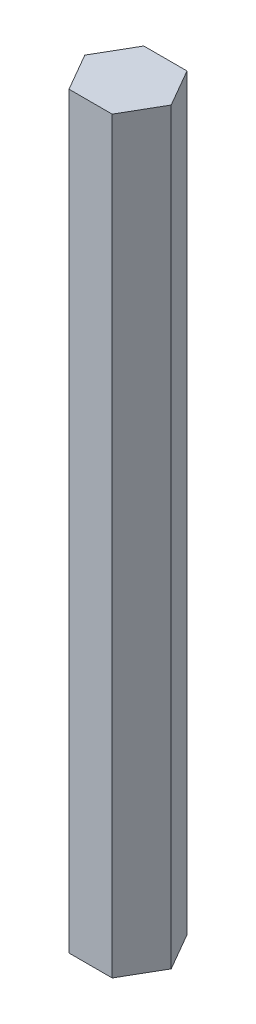
ISO-10303-21;
HEADER;
FILE_DESCRIPTION(('STEP AP214'),'2;1');
FILE_NAME('part.step','',(''),(''),'','','');
FILE_SCHEMA(('AUTOMOTIVE_DESIGN { 1 0 10303 214 1 1 1 1 }'));
ENDSEC;
DATA;
#1=APPLICATION_CONTEXT('core data for automotive mechanical design processes');
#2=APPLICATION_PROTOCOL_DEFINITION('international standard','automotive_design',2000,#1);
#3=PRODUCT_CONTEXT('',#1,'mechanical');
#4=PRODUCT('Part','Part','',(#3));
#5=PRODUCT_RELATED_PRODUCT_CATEGORY('part','',(#4));
#6=PRODUCT_DEFINITION_FORMATION('','',#4);
#7=PRODUCT_DEFINITION_CONTEXT('part definition',#1,'design');
#8=PRODUCT_DEFINITION('design','',#6,#7);
#9=PRODUCT_DEFINITION_SHAPE('','',#8);
#10=(LENGTH_UNIT() NAMED_UNIT(*) SI_UNIT(.MILLI.,.METRE.));
#11=(NAMED_UNIT(*) PLANE_ANGLE_UNIT() SI_UNIT($,.RADIAN.));
#12=(NAMED_UNIT(*) SI_UNIT($,.STERADIAN.) SOLID_ANGLE_UNIT());
#13=UNCERTAINTY_MEASURE_WITH_UNIT(LENGTH_MEASURE(1.E-05),#10,'distance_accuracy_value','');
#14=(GEOMETRIC_REPRESENTATION_CONTEXT(3) GLOBAL_UNCERTAINTY_ASSIGNED_CONTEXT((#13)) GLOBAL_UNIT_ASSIGNED_CONTEXT((#10,
#11,#12)) REPRESENTATION_CONTEXT('',''));
#15=CARTESIAN_POINT('',(0.,0.,0.));
#16=DIRECTION('',(0.,0.,1.));
#17=DIRECTION('',(1.,0.,0.));
#18=AXIS2_PLACEMENT_3D('',#15,#16,#17);
#19=CARTESIAN_POINT('',(7.33234841870825,127.,0.));
#20=DIRECTION('',(-0.866025403784438,0.,0.5));
#21=DIRECTION('',(0.5,0.,0.866025403784438));
#22=AXIS2_PLACEMENT_3D('',#19,#20,#21);
#23=PLANE('',#22);
#24=DIRECTION('',(-0.5,0.,-0.866025403784438));
#25=VECTOR('',#24,1.);
#26=CARTESIAN_POINT('',(7.33234841870825,0.,0.));
#27=LINE('',#26,#25);
#28=CARTESIAN_POINT('',(7.33234841870825,0.,0.));
#29=VERTEX_POINT('',#28);
#30=CARTESIAN_POINT('',(3.66617420935412,0.,-6.35));
#31=VERTEX_POINT('',#30);
#32=EDGE_CURVE('E117',#29,#31,#27,.T.);
#33=ORIENTED_EDGE('',*,*,#32,.T.);
#34=DIRECTION('',(0.,-1.,0.));
#35=VECTOR('',#34,1.);
#36=CARTESIAN_POINT('',(3.66617420935412,127.,-6.35));
#37=LINE('',#36,#35);
#38=CARTESIAN_POINT('',(3.66617420935412,127.,-6.35));
#39=VERTEX_POINT('',#38);
#40=EDGE_CURVE('E11',#39,#31,#37,.T.);
#41=ORIENTED_EDGE('',*,*,#40,.F.);
#42=DIRECTION('',(-0.5,0.,-0.866025403784438));
#43=VECTOR('',#42,1.);
#44=CARTESIAN_POINT('',(7.33234841870825,127.,0.));
#45=LINE('',#44,#43);
#46=CARTESIAN_POINT('',(7.33234841870825,127.,0.));
#47=VERTEX_POINT('',#46);
#48=EDGE_CURVE('E127',#47,#39,#45,.T.);
#49=ORIENTED_EDGE('',*,*,#48,.F.);
#50=DIRECTION('',(0.,-1.,0.));
#51=VECTOR('',#50,1.);
#52=CARTESIAN_POINT('',(7.33234841870825,127.,0.));
#53=LINE('',#52,#51);
#54=EDGE_CURVE('E113',#47,#29,#53,.T.);
#55=ORIENTED_EDGE('',*,*,#54,.T.);
#56=EDGE_LOOP('',(#33,#41,#49,#55));
#57=FACE_BOUND('',#56,.T.);
#58=ADVANCED_FACE('F33',(#57),#23,.F.);
#59=CARTESIAN_POINT('',(3.66617420935412,127.,-6.35));
#60=DIRECTION('',(0.,0.,1.));
#61=DIRECTION('',(1.,0.,0.));
#62=AXIS2_PLACEMENT_3D('',#59,#60,#61);
#63=PLANE('',#62);
#64=DIRECTION('',(-1.,0.,0.));
#65=VECTOR('',#64,1.);
#66=CARTESIAN_POINT('',(3.66617420935412,0.,-6.35));
#67=LINE('',#66,#65);
#68=CARTESIAN_POINT('',(-3.66617420935412,0.,-6.35));
#69=VERTEX_POINT('',#68);
#70=EDGE_CURVE('E120',#31,#69,#67,.T.);
#71=ORIENTED_EDGE('',*,*,#70,.T.);
#72=DIRECTION('',(0.,-1.,0.));
#73=VECTOR('',#72,1.);
#74=CARTESIAN_POINT('',(-3.66617420935412,127.,-6.35));
#75=LINE('',#74,#73);
#76=CARTESIAN_POINT('',(-3.66617420935412,127.,-6.35));
#77=VERTEX_POINT('',#76);
#78=EDGE_CURVE('E41',#77,#69,#75,.T.);
#79=ORIENTED_EDGE('',*,*,#78,.F.);
#80=DIRECTION('',(-1.,0.,0.));
#81=VECTOR('',#80,1.);
#82=CARTESIAN_POINT('',(3.66617420935412,127.,-6.35));
#83=LINE('',#82,#81);
#84=EDGE_CURVE('E86',#39,#77,#83,.T.);
#85=ORIENTED_EDGE('',*,*,#84,.F.);
#86=ORIENTED_EDGE('',*,*,#40,.T.);
#87=EDGE_LOOP('',(#71,#79,#85,#86));
#88=FACE_BOUND('',#87,.T.);
#89=ADVANCED_FACE('F151',(#88),#63,.F.);
#90=CARTESIAN_POINT('',(-3.66617420935412,127.,-6.35));
#91=DIRECTION('',(0.866025403784439,0.,0.5));
#92=DIRECTION('',(0.5,0.,-0.866025403784439));
#93=AXIS2_PLACEMENT_3D('',#90,#91,#92);
#94=PLANE('',#93);
#95=DIRECTION('',(-0.5,0.,0.866025403784439));
#96=VECTOR('',#95,1.);
#97=CARTESIAN_POINT('',(-3.66617420935412,0.,-6.35));
#98=LINE('',#97,#96);
#99=CARTESIAN_POINT('',(-7.33234841870824,0.,0.));
#100=VERTEX_POINT('',#99);
#101=EDGE_CURVE('E122',#69,#100,#98,.T.);
#102=ORIENTED_EDGE('',*,*,#101,.T.);
#103=DIRECTION('',(0.,-1.,0.));
#104=VECTOR('',#103,1.);
#105=CARTESIAN_POINT('',(-7.33234841870824,127.,0.));
#106=LINE('',#105,#104);
#107=CARTESIAN_POINT('',(-7.33234841870824,127.,0.));
#108=VERTEX_POINT('',#107);
#109=EDGE_CURVE('E108',#108,#100,#106,.T.);
#110=ORIENTED_EDGE('',*,*,#109,.F.);
#111=DIRECTION('',(-0.5,0.,0.866025403784439));
#112=VECTOR('',#111,1.);
#113=CARTESIAN_POINT('',(-3.66617420935412,127.,-6.35));
#114=LINE('',#113,#112);
#115=EDGE_CURVE('E99',#77,#108,#114,.T.);
#116=ORIENTED_EDGE('',*,*,#115,.F.);
#117=ORIENTED_EDGE('',*,*,#78,.T.);
#118=EDGE_LOOP('',(#102,#110,#116,#117));
#119=FACE_BOUND('',#118,.T.);
#120=ADVANCED_FACE('F133',(#119),#94,.F.);
#121=CARTESIAN_POINT('',(-7.33234841870824,127.,0.));
#122=DIRECTION('',(0.866025403784438,0.,-0.5));
#123=DIRECTION('',(-0.5,0.,-0.866025403784439));
#124=AXIS2_PLACEMENT_3D('',#121,#122,#123);
#125=PLANE('',#124);
#126=DIRECTION('',(0.5,0.,0.866025403784438));
#127=VECTOR('',#126,1.);
#128=CARTESIAN_POINT('',(-7.33234841870824,0.,0.));
#129=LINE('',#128,#127);
#130=CARTESIAN_POINT('',(-3.66617420935412,0.,6.35));
#131=VERTEX_POINT('',#130);
#132=EDGE_CURVE('E107',#100,#131,#129,.T.);
#133=ORIENTED_EDGE('',*,*,#132,.T.);
#134=DIRECTION('',(0.,-1.,0.));
#135=VECTOR('',#134,1.);
#136=CARTESIAN_POINT('',(-3.66617420935412,127.,6.35));
#137=LINE('',#136,#135);
#138=CARTESIAN_POINT('',(-3.66617420935412,127.,6.35));
#139=VERTEX_POINT('',#138);
#140=EDGE_CURVE('E104',#139,#131,#137,.T.);
#141=ORIENTED_EDGE('',*,*,#140,.F.);
#142=DIRECTION('',(0.5,0.,0.866025403784438));
#143=VECTOR('',#142,1.);
#144=CARTESIAN_POINT('',(-7.33234841870824,127.,0.));
#145=LINE('',#144,#143);
#146=EDGE_CURVE('E93',#108,#139,#145,.T.);
#147=ORIENTED_EDGE('',*,*,#146,.F.);
#148=ORIENTED_EDGE('',*,*,#109,.T.);
#149=EDGE_LOOP('',(#133,#141,#147,#148));
#150=FACE_BOUND('',#149,.T.);
#151=ADVANCED_FACE('F105',(#150),#125,.F.);
#152=CARTESIAN_POINT('',(-3.66617420935412,127.,6.35));
#153=DIRECTION('',(0.,0.,-1.));
#154=DIRECTION('',(-1.,0.,0.));
#155=AXIS2_PLACEMENT_3D('',#152,#153,#154);
#156=PLANE('',#155);
#157=DIRECTION('',(1.,0.,0.));
#158=VECTOR('',#157,1.);
#159=CARTESIAN_POINT('',(-3.66617420935412,0.,6.35));
#160=LINE('',#159,#158);
#161=CARTESIAN_POINT('',(3.66617420935412,0.,6.35));
#162=VERTEX_POINT('',#161);
#163=EDGE_CURVE('E72',#131,#162,#160,.T.);
#164=ORIENTED_EDGE('',*,*,#163,.T.);
#165=DIRECTION('',(0.,-1.,0.));
#166=VECTOR('',#165,1.);
#167=CARTESIAN_POINT('',(3.66617420935412,127.,6.35));
#168=LINE('',#167,#166);
#169=CARTESIAN_POINT('',(3.66617420935412,127.,6.35));
#170=VERTEX_POINT('',#169);
#171=EDGE_CURVE('E109',#170,#162,#168,.T.);
#172=ORIENTED_EDGE('',*,*,#171,.F.);
#173=DIRECTION('',(1.,0.,0.));
#174=VECTOR('',#173,1.);
#175=CARTESIAN_POINT('',(-3.66617420935412,127.,6.35));
#176=LINE('',#175,#174);
#177=EDGE_CURVE('E97',#139,#170,#176,.T.);
#178=ORIENTED_EDGE('',*,*,#177,.F.);
#179=ORIENTED_EDGE('',*,*,#140,.T.);
#180=EDGE_LOOP('',(#164,#172,#178,#179));
#181=FACE_BOUND('',#180,.T.);
#182=ADVANCED_FACE('F111',(#181),#156,.F.);
#183=CARTESIAN_POINT('',(3.66617420935412,127.,6.35));
#184=DIRECTION('',(-0.866025403784439,0.,-0.499999999999999));
#185=DIRECTION('',(-0.5,0.,0.866025403784439));
#186=AXIS2_PLACEMENT_3D('',#183,#184,#185);
#187=PLANE('',#186);
#188=DIRECTION('',(0.5,0.,-0.866025403784439));
#189=VECTOR('',#188,1.);
#190=CARTESIAN_POINT('',(3.66617420935412,0.,6.35));
#191=LINE('',#190,#189);
#192=EDGE_CURVE('E78',#162,#29,#191,.T.);
#193=ORIENTED_EDGE('',*,*,#192,.T.);
#194=ORIENTED_EDGE('',*,*,#54,.F.);
#195=DIRECTION('',(0.5,0.,-0.866025403784439));
#196=VECTOR('',#195,1.);
#197=CARTESIAN_POINT('',(3.66617420935412,127.,6.35));
#198=LINE('',#197,#196);
#199=EDGE_CURVE('E49',#170,#47,#198,.T.);
#200=ORIENTED_EDGE('',*,*,#199,.F.);
#201=ORIENTED_EDGE('',*,*,#171,.T.);
#202=EDGE_LOOP('',(#193,#194,#200,#201));
#203=FACE_BOUND('',#202,.T.);
#204=ADVANCED_FACE('F140',(#203),#187,.F.);
#205=CARTESIAN_POINT('',(0.,127.,0.));
#206=DIRECTION('',(0.,1.,0.));
#207=DIRECTION('',(0.,0.,1.));
#208=AXIS2_PLACEMENT_3D('',#205,#206,#207);
#209=PLANE('',#208);
#210=ORIENTED_EDGE('',*,*,#48,.T.);
#211=ORIENTED_EDGE('',*,*,#84,.T.);
#212=ORIENTED_EDGE('',*,*,#115,.T.);
#213=ORIENTED_EDGE('',*,*,#146,.T.);
#214=ORIENTED_EDGE('',*,*,#177,.T.);
#215=ORIENTED_EDGE('',*,*,#199,.T.);
#216=EDGE_LOOP('',(#210,#211,#212,#213,#214,#215));
#217=FACE_BOUND('',#216,.T.);
#218=ADVANCED_FACE('F95',(#217),#209,.T.);
#219=CARTESIAN_POINT('',(0.,0.,0.));
#220=DIRECTION('',(0.,1.,0.));
#221=DIRECTION('',(0.,0.,1.));
#222=AXIS2_PLACEMENT_3D('',#219,#220,#221);
#223=PLANE('',#222);
#224=ORIENTED_EDGE('',*,*,#32,.F.);
#225=ORIENTED_EDGE('',*,*,#192,.F.);
#226=ORIENTED_EDGE('',*,*,#163,.F.);
#227=ORIENTED_EDGE('',*,*,#132,.F.);
#228=ORIENTED_EDGE('',*,*,#101,.F.);
#229=ORIENTED_EDGE('',*,*,#70,.F.);
#230=EDGE_LOOP('',(#224,#225,#226,#227,#228,#229));
#231=FACE_BOUND('',#230,.T.);
#232=ADVANCED_FACE('F136',(#231),#223,.F.);
#233=CLOSED_SHELL('',(#58,#89,#120,#151,#182,#204,#218,#232));
#234=MANIFOLD_SOLID_BREP('B2',#233);
#235=ADVANCED_BREP_SHAPE_REPRESENTATION('',(#18,#234),#14);
#236=SHAPE_DEFINITION_REPRESENTATION(#9,#235);
ENDSEC;
END-ISO-10303-21;
